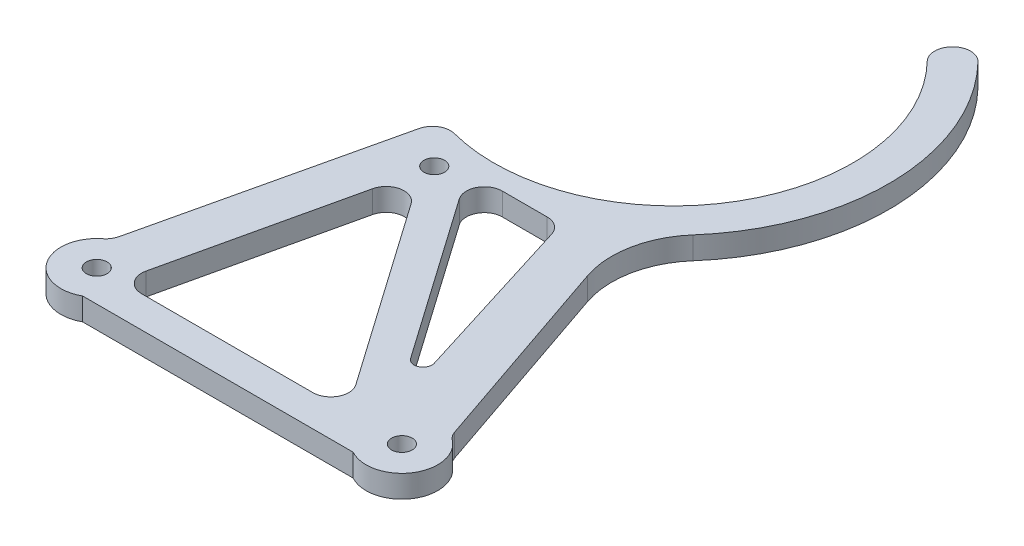
ISO-10303-21;
HEADER;
FILE_DESCRIPTION(('STEP AP214'),'2;1');
FILE_NAME('part.step','',(''),(''),'','','');
FILE_SCHEMA(('AUTOMOTIVE_DESIGN { 1 0 10303 214 1 1 1 1 }'));
ENDSEC;
DATA;
#1=APPLICATION_CONTEXT('core data for automotive mechanical design processes');
#2=APPLICATION_PROTOCOL_DEFINITION('international standard','automotive_design',2000,#1);
#3=PRODUCT_CONTEXT('',#1,'mechanical');
#4=PRODUCT('Part','Part','',(#3));
#5=PRODUCT_RELATED_PRODUCT_CATEGORY('part','',(#4));
#6=PRODUCT_DEFINITION_FORMATION('','',#4);
#7=PRODUCT_DEFINITION_CONTEXT('part definition',#1,'design');
#8=PRODUCT_DEFINITION('design','',#6,#7);
#9=PRODUCT_DEFINITION_SHAPE('','',#8);
#10=(LENGTH_UNIT() NAMED_UNIT(*) SI_UNIT(.MILLI.,.METRE.));
#11=(NAMED_UNIT(*) PLANE_ANGLE_UNIT() SI_UNIT($,.RADIAN.));
#12=(NAMED_UNIT(*) SI_UNIT($,.STERADIAN.) SOLID_ANGLE_UNIT());
#13=UNCERTAINTY_MEASURE_WITH_UNIT(LENGTH_MEASURE(1.E-05),#10,'distance_accuracy_value','');
#14=(GEOMETRIC_REPRESENTATION_CONTEXT(3) GLOBAL_UNCERTAINTY_ASSIGNED_CONTEXT((#13)) GLOBAL_UNIT_ASSIGNED_CONTEXT((#10,
#11,#12)) REPRESENTATION_CONTEXT('',''));
#15=CARTESIAN_POINT('',(0.,0.,0.));
#16=DIRECTION('',(0.,0.,1.));
#17=DIRECTION('',(1.,0.,0.));
#18=AXIS2_PLACEMENT_3D('',#15,#16,#17);
#19=CARTESIAN_POINT('',(0.,3.175,0.));
#20=DIRECTION('',(0.,1.,0.));
#21=DIRECTION('',(0.,0.,1.));
#22=AXIS2_PLACEMENT_3D('',#19,#20,#21);
#23=PLANE('',#22);
#24=CARTESIAN_POINT('',(11.43,3.175,-36.322));
#25=DIRECTION('',(0.,1.,0.));
#26=DIRECTION('',(0.,0.,1.));
#27=AXIS2_PLACEMENT_3D('',#24,#25,#26);
#28=CIRCLE('',#27,1.4605);
#29=CARTESIAN_POINT('',(11.43,3.175,-34.8615));
#30=VERTEX_POINT('',#29);
#31=EDGE_CURVE('E499',#30,#30,#28,.T.);
#32=ORIENTED_EDGE('',*,*,#31,.F.);
#33=EDGE_LOOP('',(#32));
#34=FACE_BOUND('',#33,.T.);
#35=CARTESIAN_POINT('',(15.2500981494995,3.175,-66.3346669360728));
#36=DIRECTION('',(0.,1.,0.));
#37=DIRECTION('',(0.,0.,1.));
#38=AXIS2_PLACEMENT_3D('',#35,#36,#37);
#39=CIRCLE('',#38,25.4);
#40=CARTESIAN_POINT('',(8.84643119143334,3.175,-41.7551419306914));
#41=VERTEX_POINT('',#40);
#42=CARTESIAN_POINT('',(33.4372190975799,3.175,-84.0656745673355));
#43=VERTEX_POINT('',#42);
#44=EDGE_CURVE('E387',#41,#43,#39,.T.);
#45=ORIENTED_EDGE('',*,*,#44,.F.);
#46=CARTESIAN_POINT('',(8.20606449562672,3.175,-39.2971894301532));
#47=DIRECTION('',(0.,1.,0.));
#48=DIRECTION('',(0.,0.,1.));
#49=AXIS2_PLACEMENT_3D('',#46,#47,#48);
#50=CIRCLE('',#49,2.54);
#51=CARTESIAN_POINT('',(5.73135353615715,3.175,-39.8693831622765));
#52=VERTEX_POINT('',#51);
#53=EDGE_CURVE('E347',#41,#52,#50,.T.);
#54=ORIENTED_EDGE('',*,*,#53,.T.);
#55=DIRECTION('',(0.225273122883191,0.,-0.974295653334477));
#56=VECTOR('',#55,1.);
#57=CARTESIAN_POINT('',(-3.31013792904624,3.175,-0.765358139388464));
#58=LINE('',#57,#56);
#59=CARTESIAN_POINT('',(-2.23421693067037,3.175,-5.41866581601019));
#60=VERTEX_POINT('',#59);
#61=EDGE_CURVE('E407',#60,#52,#58,.T.);
#62=ORIENTED_EDGE('',*,*,#61,.F.);
#63=CARTESIAN_POINT('',(-4.70892789013994,3.175,-5.99085954813349));
#64=DIRECTION('',(0.,1.,0.));
#65=DIRECTION('',(0.,0.,1.));
#66=AXIS2_PLACEMENT_3D('',#63,#64,#65);
#67=CIRCLE('',#66,2.54);
#68=CARTESIAN_POINT('',(-3.13928526009329,3.175,-3.99390636542233));
#69=VERTEX_POINT('',#68);
#70=EDGE_CURVE('E228',#60,#69,#67,.F.);
#71=ORIENTED_EDGE('',*,*,#70,.T.);
#72=CARTESIAN_POINT('',(0.,3.175,0.));
#73=DIRECTION('',(0.,1.,0.));
#74=DIRECTION('',(0.,0.,1.));
#75=AXIS2_PLACEMENT_3D('',#72,#73,#74);
#76=CIRCLE('',#75,5.08);
#77=CARTESIAN_POINT('',(2.45934442484171,3.175,4.445));
#78=VERTEX_POINT('',#77);
#79=EDGE_CURVE('E220',#69,#78,#76,.T.);
#80=ORIENTED_EDGE('',*,*,#79,.T.);
#81=DIRECTION('',(1.,0.,0.));
#82=VECTOR('',#81,1.);
#83=CARTESIAN_POINT('',(0.,3.175,4.445));
#84=LINE('',#83,#82);
#85=CARTESIAN_POINT('',(40.7206555751583,3.175,4.445));
#86=VERTEX_POINT('',#85);
#87=EDGE_CURVE('E225',#78,#86,#84,.T.);
#88=ORIENTED_EDGE('',*,*,#87,.T.);
#89=CARTESIAN_POINT('',(43.18,3.175,0.));
#90=DIRECTION('',(0.,1.,0.));
#91=DIRECTION('',(0.,0.,1.));
#92=AXIS2_PLACEMENT_3D('',#89,#90,#91);
#93=CIRCLE('',#92,5.08000000000001);
#94=CARTESIAN_POINT('',(46.2933663551576,3.175,-4.01414373666074));
#95=VERTEX_POINT('',#94);
#96=EDGE_CURVE('E241',#86,#95,#93,.T.);
#97=ORIENTED_EDGE('',*,*,#96,.T.);
#98=CARTESIAN_POINT('',(47.8500495327364,3.175,-6.02121560499111));
#99=DIRECTION('',(0.,1.,0.));
#100=DIRECTION('',(0.,0.,1.));
#101=AXIS2_PLACEMENT_3D('',#98,#99,#100);
#102=CIRCLE('',#101,2.54);
#103=CARTESIAN_POINT('',(45.4464675004593,3.175,-5.20000100811969));
#104=VERTEX_POINT('',#103);
#105=EDGE_CURVE('E361',#95,#104,#102,.F.);
#106=ORIENTED_EDGE('',*,*,#105,.T.);
#107=DIRECTION('',(-0.323312833413946,0.,-0.946292138691771));
#108=VECTOR('',#107,1.);
#109=CARTESIAN_POINT('',(42.2868262008053,3.175,-14.4478359652935));
#110=LINE('',#109,#108);
#111=CARTESIAN_POINT('',(35.6913169063117,3.175,-33.7519833761604));
#112=VERTEX_POINT('',#111);
#113=EDGE_CURVE('E396',#104,#112,#110,.T.);
#114=ORIENTED_EDGE('',*,*,#113,.T.);
#115=CARTESIAN_POINT('',(47.7092270676971,3.175,-37.8580563605175));
#116=DIRECTION('',(0.,1.,0.));
#117=DIRECTION('',(0.,0.,1.));
#118=AXIS2_PLACEMENT_3D('',#115,#116,#117);
#119=CIRCLE('',#118,12.7);
#120=CARTESIAN_POINT('',(38.1624244446978,3.175,-46.2335300592103));
#121=VERTEX_POINT('',#120);
#122=EDGE_CURVE('E320',#112,#121,#119,.F.);
#123=ORIENTED_EDGE('',*,*,#122,.T.);
#124=CARTESIAN_POINT('',(15.2500981494995,3.175,-66.3346669360728));
#125=DIRECTION('',(0.,1.,0.));
#126=DIRECTION('',(0.,0.,1.));
#127=AXIS2_PLACEMENT_3D('',#124,#125,#126);
#128=CIRCLE('',#127,30.48);
#129=CARTESIAN_POINT('',(37.074643287196,3.175,-87.611876093588));
#130=VERTEX_POINT('',#129);
#131=EDGE_CURVE('E384',#130,#121,#128,.F.);
#132=ORIENTED_EDGE('',*,*,#131,.F.);
#133=CARTESIAN_POINT('',(35.2559311923879,3.175,-85.8387753304617));
#134=DIRECTION('',(0.,1.,0.));
#135=DIRECTION('',(0.,0.,1.));
#136=AXIS2_PLACEMENT_3D('',#133,#134,#135);
#137=CIRCLE('',#136,2.54);
#138=CARTESIAN_POINT('',(33.3248350297801,3.175,-87.4887655155118));
#139=VERTEX_POINT('',#138);
#140=EDGE_CURVE('E345',#130,#139,#137,.T.);
#141=ORIENTED_EDGE('',*,*,#140,.T.);
#142=CARTESIAN_POINT('',(35.2559311923879,3.175,-85.8387753304617));
#143=DIRECTION('',(0.,1.,0.));
#144=DIRECTION('',(0.,0.,1.));
#145=AXIS2_PLACEMENT_3D('',#142,#143,#144);
#146=CIRCLE('',#145,2.54);
#147=EDGE_CURVE('E343',#139,#43,#146,.T.);
#148=ORIENTED_EDGE('',*,*,#147,.T.);
#149=EDGE_LOOP('',(#45,#54,#62,#71,#80,#88,#97,#106,#114,#123,#132,#141,#148));
#150=FACE_BOUND('',#149,.T.);
#151=CARTESIAN_POINT('',(0.,3.175,0.));
#152=DIRECTION('',(0.,1.,0.));
#153=DIRECTION('',(0.,0.,1.));
#154=AXIS2_PLACEMENT_3D('',#151,#152,#153);
#155=CIRCLE('',#154,1.4605);
#156=CARTESIAN_POINT('',(0.,3.175,1.4605));
#157=VERTEX_POINT('',#156);
#158=EDGE_CURVE('E232',#157,#157,#155,.T.);
#159=ORIENTED_EDGE('',*,*,#158,.F.);
#160=EDGE_LOOP('',(#159));
#161=FACE_BOUND('',#160,.T.);
#162=CARTESIAN_POINT('',(43.18,3.175,0.));
#163=DIRECTION('',(0.,1.,0.));
#164=DIRECTION('',(0.,0.,1.));
#165=AXIS2_PLACEMENT_3D('',#162,#163,#164);
#166=CIRCLE('',#165,1.46050000000001);
#167=CARTESIAN_POINT('',(43.18,3.175,1.46050000000001));
#168=VERTEX_POINT('',#167);
#169=EDGE_CURVE('E251',#168,#168,#166,.T.);
#170=ORIENTED_EDGE('',*,*,#169,.F.);
#171=EDGE_LOOP('',(#170));
#172=FACE_BOUND('',#171,.T.);
#173=DIRECTION('',(0.57357643635105,0.,0.819152044288989));
#174=VECTOR('',#173,1.);
#175=CARTESIAN_POINT('',(27.5646468935247,3.175,-19.3009735429351));
#176=LINE('',#175,#174);
#177=CARTESIAN_POINT('',(17.2000752672967,3.175,-34.1031158516683));
#178=VERTEX_POINT('',#177);
#179=CARTESIAN_POINT('',(33.3175160696928,3.175,-11.0850248959425));
#180=VERTEX_POINT('',#179);
#181=EDGE_CURVE('E385',#178,#180,#176,.T.);
#182=ORIENTED_EDGE('',*,*,#181,.F.);
#183=CARTESIAN_POINT('',(19.2807214597907,3.175,-35.56));
#184=DIRECTION('',(0.,1.,0.));
#185=DIRECTION('',(0.,0.,1.));
#186=AXIS2_PLACEMENT_3D('',#183,#184,#185);
#187=CIRCLE('',#186,2.54);
#188=CARTESIAN_POINT('',(19.2807214597907,3.175,-38.1));
#189=VERTEX_POINT('',#188);
#190=EDGE_CURVE('E294',#178,#189,#187,.F.);
#191=ORIENTED_EDGE('',*,*,#190,.T.);
#192=DIRECTION('',(1.,0.,0.));
#193=VECTOR('',#192,1.);
#194=CARTESIAN_POINT('',(0.,3.175,-38.1));
#195=LINE('',#194,#193);
#196=CARTESIAN_POINT('',(25.6264955663798,3.175,-38.1));
#197=VERTEX_POINT('',#196);
#198=EDGE_CURVE('E389',#189,#197,#195,.T.);
#199=ORIENTED_EDGE('',*,*,#198,.T.);
#200=CARTESIAN_POINT('',(25.6264955663798,3.175,-35.56));
#201=DIRECTION('',(0.,1.,0.));
#202=DIRECTION('',(0.,0.,1.));
#203=AXIS2_PLACEMENT_3D('',#200,#201,#202);
#204=CIRCLE('',#203,2.54);
#205=CARTESIAN_POINT('',(28.051446795848,3.175,-36.3157853760829));
#206=VERTEX_POINT('',#205);
#207=EDGE_CURVE('E302',#197,#206,#204,.F.);
#208=ORIENTED_EDGE('',*,*,#207,.T.);
#209=DIRECTION('',(0.29755329767044,0.,0.954705208452036));
#210=VECTOR('',#209,1.);
#211=CARTESIAN_POINT('',(35.8842603197392,3.175,-11.1840596427828));
#212=LINE('',#211,#210);
#213=CARTESIAN_POINT('',(35.5703147806739,3.175,-12.1913596581498));
#214=VERTEX_POINT('',#213);
#215=EDGE_CURVE('E377',#206,#214,#212,.T.);
#216=ORIENTED_EDGE('',*,*,#215,.T.);
#217=CARTESIAN_POINT('',(34.3578391659398,3.175,-11.8134669701083));
#218=DIRECTION('',(0.,1.,0.));
#219=DIRECTION('',(0.,0.,1.));
#220=AXIS2_PLACEMENT_3D('',#217,#218,#219);
#221=CIRCLE('',#220,1.27);
#222=EDGE_CURVE('E62',#214,#180,#221,.F.);
#223=ORIENTED_EDGE('',*,*,#222,.T.);
#224=EDGE_LOOP('',(#182,#191,#199,#208,#216,#223));
#225=FACE_BOUND('',#224,.T.);
#226=DIRECTION('',(-1.,0.,0.));
#227=VECTOR('',#226,1.);
#228=CARTESIAN_POINT('',(0.,3.175,0.));
#229=LINE('',#228,#227);
#230=CARTESIAN_POINT('',(30.5795400792316,3.175,0.));
#231=VERTEX_POINT('',#230);
#232=CARTESIAN_POINT('',(6.35750869969889,3.175,0.));
#233=VERTEX_POINT('',#232);
#234=EDGE_CURVE('E509',#231,#233,#229,.T.);
#235=ORIENTED_EDGE('',*,*,#234,.T.);
#236=CARTESIAN_POINT('',(6.35750869969889,3.175,-2.54));
#237=DIRECTION('',(0.,1.,0.));
#238=DIRECTION('',(0.,0.,1.));
#239=AXIS2_PLACEMENT_3D('',#236,#237,#238);
#240=CIRCLE('',#239,2.54);
#241=CARTESIAN_POINT('',(3.88075108191546,3.175,-3.10326876600051));
#242=VERTEX_POINT('',#241);
#243=EDGE_CURVE('E310',#233,#242,#240,.F.);
#244=ORIENTED_EDGE('',*,*,#243,.T.);
#245=DIRECTION('',(0.221759356693111,0.,-0.975101424324187));
#246=VECTOR('',#245,1.);
#247=CARTESIAN_POINT('',(3.01886235100801,3.175,0.686555220005522));
#248=LINE('',#247,#246);
#249=CARTESIAN_POINT('',(9.8191344603085,3.175,-29.2150242148023));
#250=VERTEX_POINT('',#249);
#251=EDGE_CURVE('E506',#242,#250,#248,.T.);
#252=ORIENTED_EDGE('',*,*,#251,.T.);
#253=CARTESIAN_POINT('',(12.2958920780919,3.175,-28.6517554488018));
#254=DIRECTION('',(0.,1.,0.));
#255=DIRECTION('',(0.,0.,1.));
#256=AXIS2_PLACEMENT_3D('',#253,#254,#255);
#257=CIRCLE('',#256,2.54);
#258=CARTESIAN_POINT('',(14.376538270586,3.175,-30.1086395971334));
#259=VERTEX_POINT('',#258);
#260=EDGE_CURVE('E298',#250,#259,#257,.F.);
#261=ORIENTED_EDGE('',*,*,#260,.T.);
#262=DIRECTION('',(0.57357643635105,0.,0.819152044288989));
#263=VECTOR('',#262,1.);
#264=CARTESIAN_POINT('',(23.7932352008737,3.175,-16.6602026460485));
#265=LINE('',#264,#263);
#266=CARTESIAN_POINT('',(32.6601862717256,3.175,-3.99688414833168));
#267=VERTEX_POINT('',#266);
#268=EDGE_CURVE('E369',#259,#267,#265,.T.);
#269=ORIENTED_EDGE('',*,*,#268,.T.);
#270=CARTESIAN_POINT('',(30.5795400792316,3.175,-2.54000000000001));
#271=DIRECTION('',(0.,1.,0.));
#272=DIRECTION('',(0.,0.,1.));
#273=AXIS2_PLACEMENT_3D('',#270,#271,#272);
#274=CIRCLE('',#273,2.54);
#275=EDGE_CURVE('E306',#267,#231,#274,.F.);
#276=ORIENTED_EDGE('',*,*,#275,.T.);
#277=EDGE_LOOP('',(#235,#244,#252,#261,#269,#276));
#278=FACE_BOUND('',#277,.T.);
#279=ADVANCED_FACE('F53',(#34,#150,#161,#172,#225,#278),#23,.T.);
#280=CARTESIAN_POINT('',(0.,0.,0.));
#281=DIRECTION('',(0.,1.,0.));
#282=DIRECTION('',(0.,0.,1.));
#283=AXIS2_PLACEMENT_3D('',#280,#281,#282);
#284=PLANE('',#283);
#285=CARTESIAN_POINT('',(11.43,0.,-36.322));
#286=DIRECTION('',(0.,1.,0.));
#287=DIRECTION('',(0.,0.,1.));
#288=AXIS2_PLACEMENT_3D('',#285,#286,#287);
#289=CIRCLE('',#288,1.4605);
#290=CARTESIAN_POINT('',(11.43,0.,-34.8615));
#291=VERTEX_POINT('',#290);
#292=EDGE_CURVE('E57',#291,#291,#289,.T.);
#293=ORIENTED_EDGE('',*,*,#292,.T.);
#294=EDGE_LOOP('',(#293));
#295=FACE_BOUND('',#294,.T.);
#296=DIRECTION('',(1.,0.,0.));
#297=VECTOR('',#296,1.);
#298=CARTESIAN_POINT('',(0.,0.,-38.1));
#299=LINE('',#298,#297);
#300=CARTESIAN_POINT('',(19.2807214597907,0.,-38.1));
#301=VERTEX_POINT('',#300);
#302=CARTESIAN_POINT('',(25.6264955663798,0.,-38.1));
#303=VERTEX_POINT('',#302);
#304=EDGE_CURVE('E257',#301,#303,#299,.T.);
#305=ORIENTED_EDGE('',*,*,#304,.F.);
#306=CARTESIAN_POINT('',(19.2807214597907,0.,-35.56));
#307=DIRECTION('',(0.,1.,0.));
#308=DIRECTION('',(0.,0.,1.));
#309=AXIS2_PLACEMENT_3D('',#306,#307,#308);
#310=CIRCLE('',#309,2.54);
#311=CARTESIAN_POINT('',(17.2000752672967,0.,-34.1031158516683));
#312=VERTEX_POINT('',#311);
#313=EDGE_CURVE('E296',#301,#312,#310,.T.);
#314=ORIENTED_EDGE('',*,*,#313,.T.);
#315=DIRECTION('',(0.57357643635105,0.,0.819152044288989));
#316=VECTOR('',#315,1.);
#317=CARTESIAN_POINT('',(27.5646468935247,0.,-19.3009735429351));
#318=LINE('',#317,#316);
#319=CARTESIAN_POINT('',(33.3175160696928,0.,-11.0850248959425));
#320=VERTEX_POINT('',#319);
#321=EDGE_CURVE('E247',#312,#320,#318,.T.);
#322=ORIENTED_EDGE('',*,*,#321,.T.);
#323=CARTESIAN_POINT('',(34.3578391659398,0.,-11.8134669701083));
#324=DIRECTION('',(0.,1.,0.));
#325=DIRECTION('',(0.,0.,1.));
#326=AXIS2_PLACEMENT_3D('',#323,#324,#325);
#327=CIRCLE('',#326,1.27);
#328=CARTESIAN_POINT('',(35.5703147806739,0.,-12.1913596581498));
#329=VERTEX_POINT('',#328);
#330=EDGE_CURVE('E12',#320,#329,#327,.T.);
#331=ORIENTED_EDGE('',*,*,#330,.T.);
#332=DIRECTION('',(0.29755329767044,0.,0.954705208452036));
#333=VECTOR('',#332,1.);
#334=CARTESIAN_POINT('',(35.8842603197392,0.,-11.1840596427828));
#335=LINE('',#334,#333);
#336=CARTESIAN_POINT('',(28.051446795848,0.,-36.3157853760829));
#337=VERTEX_POINT('',#336);
#338=EDGE_CURVE('E249',#337,#329,#335,.T.);
#339=ORIENTED_EDGE('',*,*,#338,.F.);
#340=CARTESIAN_POINT('',(25.6264955663798,0.,-35.56));
#341=DIRECTION('',(0.,1.,0.));
#342=DIRECTION('',(0.,0.,1.));
#343=AXIS2_PLACEMENT_3D('',#340,#341,#342);
#344=CIRCLE('',#343,2.54);
#345=EDGE_CURVE('E304',#337,#303,#344,.T.);
#346=ORIENTED_EDGE('',*,*,#345,.T.);
#347=EDGE_LOOP('',(#305,#314,#322,#331,#339,#346));
#348=FACE_BOUND('',#347,.T.);
#349=DIRECTION('',(0.225273122883191,0.,-0.974295653334477));
#350=VECTOR('',#349,1.);
#351=CARTESIAN_POINT('',(-3.31013792904624,0.,-0.765358139388464));
#352=LINE('',#351,#350);
#353=CARTESIAN_POINT('',(-2.23421693067037,0.,-5.41866581601019));
#354=VERTEX_POINT('',#353);
#355=CARTESIAN_POINT('',(5.73135353615715,0.,-39.8693831622765));
#356=VERTEX_POINT('',#355);
#357=EDGE_CURVE('E399',#354,#356,#352,.T.);
#358=ORIENTED_EDGE('',*,*,#357,.T.);
#359=CARTESIAN_POINT('',(8.20606449562672,0.,-39.2971894301532));
#360=DIRECTION('',(0.,1.,0.));
#361=DIRECTION('',(0.,0.,1.));
#362=AXIS2_PLACEMENT_3D('',#359,#360,#361);
#363=CIRCLE('',#362,2.54);
#364=CARTESIAN_POINT('',(8.84643119143334,0.,-41.7551419306914));
#365=VERTEX_POINT('',#364);
#366=EDGE_CURVE('E353',#356,#365,#363,.F.);
#367=ORIENTED_EDGE('',*,*,#366,.T.);
#368=CARTESIAN_POINT('',(15.2500981494995,0.,-66.3346669360728));
#369=DIRECTION('',(0.,1.,0.));
#370=DIRECTION('',(0.,0.,1.));
#371=AXIS2_PLACEMENT_3D('',#368,#369,#370);
#372=CIRCLE('',#371,25.4);
#373=CARTESIAN_POINT('',(33.4372190975799,0.,-84.0656745673355));
#374=VERTEX_POINT('',#373);
#375=EDGE_CURVE('E395',#365,#374,#372,.T.);
#376=ORIENTED_EDGE('',*,*,#375,.T.);
#377=CARTESIAN_POINT('',(35.2559311923879,0.,-85.8387753304617));
#378=DIRECTION('',(0.,1.,0.));
#379=DIRECTION('',(0.,0.,1.));
#380=AXIS2_PLACEMENT_3D('',#377,#378,#379);
#381=CIRCLE('',#380,2.54);
#382=CARTESIAN_POINT('',(33.3248350297801,0.,-87.4887655155118));
#383=VERTEX_POINT('',#382);
#384=EDGE_CURVE('E349',#374,#383,#381,.F.);
#385=ORIENTED_EDGE('',*,*,#384,.T.);
#386=CARTESIAN_POINT('',(35.2559311923879,0.,-85.8387753304617));
#387=DIRECTION('',(0.,1.,0.));
#388=DIRECTION('',(0.,0.,1.));
#389=AXIS2_PLACEMENT_3D('',#386,#387,#388);
#390=CIRCLE('',#389,2.54);
#391=CARTESIAN_POINT('',(37.074643287196,0.,-87.611876093588));
#392=VERTEX_POINT('',#391);
#393=EDGE_CURVE('E351',#383,#392,#390,.F.);
#394=ORIENTED_EDGE('',*,*,#393,.T.);
#395=CARTESIAN_POINT('',(15.2500981494995,0.,-66.3346669360728));
#396=DIRECTION('',(0.,1.,0.));
#397=DIRECTION('',(0.,0.,1.));
#398=AXIS2_PLACEMENT_3D('',#395,#396,#397);
#399=CIRCLE('',#398,30.48);
#400=CARTESIAN_POINT('',(38.1624244446978,0.,-46.2335300592103));
#401=VERTEX_POINT('',#400);
#402=EDGE_CURVE('E393',#392,#401,#399,.F.);
#403=ORIENTED_EDGE('',*,*,#402,.T.);
#404=CARTESIAN_POINT('',(47.7092270676971,0.,-37.8580563605175));
#405=DIRECTION('',(0.,1.,0.));
#406=DIRECTION('',(0.,0.,1.));
#407=AXIS2_PLACEMENT_3D('',#404,#405,#406);
#408=CIRCLE('',#407,12.7);
#409=CARTESIAN_POINT('',(35.6913169063117,0.,-33.7519833761604));
#410=VERTEX_POINT('',#409);
#411=EDGE_CURVE('E323',#401,#410,#408,.T.);
#412=ORIENTED_EDGE('',*,*,#411,.T.);
#413=DIRECTION('',(-0.323312833413946,0.,-0.946292138691771));
#414=VECTOR('',#413,1.);
#415=CARTESIAN_POINT('',(42.2868262008053,0.,-14.4478359652935));
#416=LINE('',#415,#414);
#417=CARTESIAN_POINT('',(45.4464675004593,0.,-5.20000100811969));
#418=VERTEX_POINT('',#417);
#419=EDGE_CURVE('E402',#418,#410,#416,.T.);
#420=ORIENTED_EDGE('',*,*,#419,.F.);
#421=CARTESIAN_POINT('',(47.8500495327364,0.,-6.02121560499111));
#422=DIRECTION('',(0.,1.,0.));
#423=DIRECTION('',(0.,0.,1.));
#424=AXIS2_PLACEMENT_3D('',#421,#422,#423);
#425=CIRCLE('',#424,2.54);
#426=CARTESIAN_POINT('',(46.2933663551576,0.,-4.01414373666074));
#427=VERTEX_POINT('',#426);
#428=EDGE_CURVE('E363',#418,#427,#425,.T.);
#429=ORIENTED_EDGE('',*,*,#428,.T.);
#430=CARTESIAN_POINT('',(43.18,0.,0.));
#431=DIRECTION('',(0.,1.,0.));
#432=DIRECTION('',(0.,0.,1.));
#433=AXIS2_PLACEMENT_3D('',#430,#431,#432);
#434=CIRCLE('',#433,5.08000000000001);
#435=CARTESIAN_POINT('',(40.7206555751583,0.,4.445));
#436=VERTEX_POINT('',#435);
#437=EDGE_CURVE('E422',#436,#427,#434,.T.);
#438=ORIENTED_EDGE('',*,*,#437,.F.);
#439=DIRECTION('',(1.,0.,0.));
#440=VECTOR('',#439,1.);
#441=CARTESIAN_POINT('',(0.,0.,4.445));
#442=LINE('',#441,#440);
#443=CARTESIAN_POINT('',(2.45934442484171,0.,4.445));
#444=VERTEX_POINT('',#443);
#445=EDGE_CURVE('E420',#444,#436,#442,.T.);
#446=ORIENTED_EDGE('',*,*,#445,.F.);
#447=CARTESIAN_POINT('',(0.,0.,0.));
#448=DIRECTION('',(0.,1.,0.));
#449=DIRECTION('',(0.,0.,1.));
#450=AXIS2_PLACEMENT_3D('',#447,#448,#449);
#451=CIRCLE('',#450,5.08);
#452=CARTESIAN_POINT('',(-3.13928526009329,0.,-3.99390636542233));
#453=VERTEX_POINT('',#452);
#454=EDGE_CURVE('E245',#453,#444,#451,.T.);
#455=ORIENTED_EDGE('',*,*,#454,.F.);
#456=CARTESIAN_POINT('',(-4.70892789013994,0.,-5.99085954813349));
#457=DIRECTION('',(0.,1.,0.));
#458=DIRECTION('',(0.,0.,1.));
#459=AXIS2_PLACEMENT_3D('',#456,#457,#458);
#460=CIRCLE('',#459,2.54);
#461=EDGE_CURVE('E359',#453,#354,#460,.T.);
#462=ORIENTED_EDGE('',*,*,#461,.T.);
#463=EDGE_LOOP('',(#358,#367,#376,#385,#394,#403,#412,#420,#429,#438,#446,#455,#462));
#464=FACE_BOUND('',#463,.T.);
#465=CARTESIAN_POINT('',(0.,0.,0.));
#466=DIRECTION('',(0.,1.,0.));
#467=DIRECTION('',(0.,0.,1.));
#468=AXIS2_PLACEMENT_3D('',#465,#466,#467);
#469=CIRCLE('',#468,1.4605);
#470=CARTESIAN_POINT('',(0.,0.,1.4605));
#471=VERTEX_POINT('',#470);
#472=EDGE_CURVE('E403',#471,#471,#469,.T.);
#473=ORIENTED_EDGE('',*,*,#472,.T.);
#474=EDGE_LOOP('',(#473));
#475=FACE_BOUND('',#474,.T.);
#476=CARTESIAN_POINT('',(43.18,0.,0.));
#477=DIRECTION('',(0.,1.,0.));
#478=DIRECTION('',(0.,0.,1.));
#479=AXIS2_PLACEMENT_3D('',#476,#477,#478);
#480=CIRCLE('',#479,1.46050000000001);
#481=CARTESIAN_POINT('',(43.18,0.,1.46050000000001));
#482=VERTEX_POINT('',#481);
#483=EDGE_CURVE('E412',#482,#482,#480,.T.);
#484=ORIENTED_EDGE('',*,*,#483,.T.);
#485=EDGE_LOOP('',(#484));
#486=FACE_BOUND('',#485,.T.);
#487=DIRECTION('',(0.57357643635105,0.,0.819152044288989));
#488=VECTOR('',#487,1.);
#489=CARTESIAN_POINT('',(23.7932352008737,0.,-16.6602026460485));
#490=LINE('',#489,#488);
#491=CARTESIAN_POINT('',(14.376538270586,0.,-30.1086395971334));
#492=VERTEX_POINT('',#491);
#493=CARTESIAN_POINT('',(32.6601862717256,0.,-3.99688414833168));
#494=VERTEX_POINT('',#493);
#495=EDGE_CURVE('E266',#492,#494,#490,.T.);
#496=ORIENTED_EDGE('',*,*,#495,.F.);
#497=CARTESIAN_POINT('',(12.2958920780919,0.,-28.6517554488018));
#498=DIRECTION('',(0.,1.,0.));
#499=DIRECTION('',(0.,0.,1.));
#500=AXIS2_PLACEMENT_3D('',#497,#498,#499);
#501=CIRCLE('',#500,2.54);
#502=CARTESIAN_POINT('',(9.8191344603085,0.,-29.2150242148023));
#503=VERTEX_POINT('',#502);
#504=EDGE_CURVE('E300',#492,#503,#501,.T.);
#505=ORIENTED_EDGE('',*,*,#504,.T.);
#506=DIRECTION('',(0.221759356693111,0.,-0.975101424324187));
#507=VECTOR('',#506,1.);
#508=CARTESIAN_POINT('',(3.01886235100801,0.,0.686555220005522));
#509=LINE('',#508,#507);
#510=CARTESIAN_POINT('',(3.88075108191546,0.,-3.10326876600051));
#511=VERTEX_POINT('',#510);
#512=EDGE_CURVE('E260',#511,#503,#509,.T.);
#513=ORIENTED_EDGE('',*,*,#512,.F.);
#514=CARTESIAN_POINT('',(6.35750869969889,0.,-2.54));
#515=DIRECTION('',(0.,1.,0.));
#516=DIRECTION('',(0.,0.,1.));
#517=AXIS2_PLACEMENT_3D('',#514,#515,#516);
#518=CIRCLE('',#517,2.54);
#519=CARTESIAN_POINT('',(6.35750869969889,0.,0.));
#520=VERTEX_POINT('',#519);
#521=EDGE_CURVE('E312',#511,#520,#518,.T.);
#522=ORIENTED_EDGE('',*,*,#521,.T.);
#523=DIRECTION('',(-1.,0.,0.));
#524=VECTOR('',#523,1.);
#525=CARTESIAN_POINT('',(0.,0.,0.));
#526=LINE('',#525,#524);
#527=CARTESIAN_POINT('',(30.5795400792316,0.,0.));
#528=VERTEX_POINT('',#527);
#529=EDGE_CURVE('E263',#528,#520,#526,.T.);
#530=ORIENTED_EDGE('',*,*,#529,.F.);
#531=CARTESIAN_POINT('',(30.5795400792316,0.,-2.54000000000001));
#532=DIRECTION('',(0.,1.,0.));
#533=DIRECTION('',(0.,0.,1.));
#534=AXIS2_PLACEMENT_3D('',#531,#532,#533);
#535=CIRCLE('',#534,2.54);
#536=EDGE_CURVE('E308',#528,#494,#535,.T.);
#537=ORIENTED_EDGE('',*,*,#536,.T.);
#538=EDGE_LOOP('',(#496,#505,#513,#522,#530,#537));
#539=FACE_BOUND('',#538,.T.);
#540=ADVANCED_FACE('F427',(#295,#348,#464,#475,#486,#539),#284,.F.);
#541=CARTESIAN_POINT('',(0.,3.175,0.));
#542=DIRECTION('',(0.,-1.,0.));
#543=DIRECTION('',(0.,0.,-1.));
#544=AXIS2_PLACEMENT_3D('',#541,#542,#543);
#545=CYLINDRICAL_SURFACE('',#544,5.08);
#546=ORIENTED_EDGE('',*,*,#79,.F.);
#547=DIRECTION('',(0.,-1.,0.));
#548=VECTOR('',#547,1.);
#549=CARTESIAN_POINT('',(-3.13928526009329,3.175,-3.99390636542233));
#550=LINE('',#549,#548);
#551=EDGE_CURVE('E331',#69,#453,#550,.T.);
#552=ORIENTED_EDGE('',*,*,#551,.T.);
#553=ORIENTED_EDGE('',*,*,#454,.T.);
#554=DIRECTION('',(0.,-1.,0.));
#555=VECTOR('',#554,1.);
#556=CARTESIAN_POINT('',(2.45934442484171,3.175,4.445));
#557=LINE('',#556,#555);
#558=EDGE_CURVE('E237',#78,#444,#557,.T.);
#559=ORIENTED_EDGE('',*,*,#558,.F.);
#560=EDGE_LOOP('',(#546,#552,#553,#559));
#561=FACE_BOUND('',#560,.T.);
#562=ADVANCED_FACE('F243',(#561),#545,.T.);
#563=CARTESIAN_POINT('',(0.,3.175,4.445));
#564=DIRECTION('',(0.,0.,-1.));
#565=DIRECTION('',(-1.,0.,0.));
#566=AXIS2_PLACEMENT_3D('',#563,#564,#565);
#567=PLANE('',#566);
#568=ORIENTED_EDGE('',*,*,#445,.T.);
#569=DIRECTION('',(0.,-1.,0.));
#570=VECTOR('',#569,1.);
#571=CARTESIAN_POINT('',(40.7206555751583,3.175,4.445));
#572=LINE('',#571,#570);
#573=EDGE_CURVE('E239',#86,#436,#572,.T.);
#574=ORIENTED_EDGE('',*,*,#573,.F.);
#575=ORIENTED_EDGE('',*,*,#87,.F.);
#576=ORIENTED_EDGE('',*,*,#558,.T.);
#577=EDGE_LOOP('',(#568,#574,#575,#576));
#578=FACE_BOUND('',#577,.T.);
#579=ADVANCED_FACE('F236',(#578),#567,.F.);
#580=CARTESIAN_POINT('',(43.18,3.175,0.));
#581=DIRECTION('',(0.,-1.,0.));
#582=DIRECTION('',(0.,0.,-1.));
#583=AXIS2_PLACEMENT_3D('',#580,#581,#582);
#584=CYLINDRICAL_SURFACE('',#583,5.08000000000001);
#585=ORIENTED_EDGE('',*,*,#437,.T.);
#586=DIRECTION('',(0.,-1.,0.));
#587=VECTOR('',#586,1.);
#588=CARTESIAN_POINT('',(46.2933663551576,3.175,-4.01414373666074));
#589=LINE('',#588,#587);
#590=EDGE_CURVE('E333',#427,#95,#589,.F.);
#591=ORIENTED_EDGE('',*,*,#590,.T.);
#592=ORIENTED_EDGE('',*,*,#96,.F.);
#593=ORIENTED_EDGE('',*,*,#573,.T.);
#594=EDGE_LOOP('',(#585,#591,#592,#593));
#595=FACE_BOUND('',#594,.T.);
#596=ADVANCED_FACE('F443',(#595),#584,.T.);
#597=CARTESIAN_POINT('',(0.,3.175,0.));
#598=DIRECTION('',(0.,-1.,0.));
#599=DIRECTION('',(0.,0.,-1.));
#600=AXIS2_PLACEMENT_3D('',#597,#598,#599);
#601=CYLINDRICAL_SURFACE('',#600,1.4605);
#602=ORIENTED_EDGE('',*,*,#158,.T.);
#603=EDGE_LOOP('',(#602));
#604=FACE_BOUND('',#603,.T.);
#605=ORIENTED_EDGE('',*,*,#472,.F.);
#606=EDGE_LOOP('',(#605));
#607=FACE_BOUND('',#606,.T.);
#608=ADVANCED_FACE('F433',(#604,#607),#601,.F.);
#609=CARTESIAN_POINT('',(43.18,3.175,0.));
#610=DIRECTION('',(0.,-1.,0.));
#611=DIRECTION('',(0.,0.,-1.));
#612=AXIS2_PLACEMENT_3D('',#609,#610,#611);
#613=CYLINDRICAL_SURFACE('',#612,1.46050000000001);
#614=ORIENTED_EDGE('',*,*,#169,.T.);
#615=EDGE_LOOP('',(#614));
#616=FACE_BOUND('',#615,.T.);
#617=ORIENTED_EDGE('',*,*,#483,.F.);
#618=EDGE_LOOP('',(#617));
#619=FACE_BOUND('',#618,.T.);
#620=ADVANCED_FACE('F430',(#616,#619),#613,.F.);
#621=CARTESIAN_POINT('',(15.2500981494995,0.,-66.3346669360728));
#622=DIRECTION('',(0.,1.,0.));
#623=DIRECTION('',(0.,0.,1.));
#624=AXIS2_PLACEMENT_3D('',#621,#622,#623);
#625=CYLINDRICAL_SURFACE('',#624,30.48);
#626=ORIENTED_EDGE('',*,*,#402,.F.);
#627=DIRECTION('',(0.,1.,0.));
#628=VECTOR('',#627,1.);
#629=CARTESIAN_POINT('',(37.074643287196,0.,-87.611876093588));
#630=LINE('',#629,#628);
#631=EDGE_CURVE('E355',#392,#130,#630,.T.);
#632=ORIENTED_EDGE('',*,*,#631,.T.);
#633=ORIENTED_EDGE('',*,*,#131,.T.);
#634=DIRECTION('',(0.,1.,0.));
#635=VECTOR('',#634,1.);
#636=CARTESIAN_POINT('',(38.1624244446978,0.,-46.2335300592103));
#637=LINE('',#636,#635);
#638=EDGE_CURVE('E317',#121,#401,#637,.F.);
#639=ORIENTED_EDGE('',*,*,#638,.T.);
#640=EDGE_LOOP('',(#626,#632,#633,#639));
#641=FACE_BOUND('',#640,.T.);
#642=ADVANCED_FACE('F432',(#641),#625,.T.);
#643=CARTESIAN_POINT('',(42.2868262008053,0.,-14.4478359652935));
#644=DIRECTION('',(0.946292138691771,0.,-0.323312833413946));
#645=DIRECTION('',(-0.323312833413946,0.,-0.946292138691771));
#646=AXIS2_PLACEMENT_3D('',#643,#644,#645);
#647=PLANE('',#646);
#648=ORIENTED_EDGE('',*,*,#113,.F.);
#649=DIRECTION('',(0.,-1.,0.));
#650=VECTOR('',#649,1.);
#651=CARTESIAN_POINT('',(45.4464675004593,0.,-5.20000100811969));
#652=LINE('',#651,#650);
#653=EDGE_CURVE('E336',#104,#418,#652,.T.);
#654=ORIENTED_EDGE('',*,*,#653,.T.);
#655=ORIENTED_EDGE('',*,*,#419,.T.);
#656=DIRECTION('',(0.,1.,0.));
#657=VECTOR('',#656,1.);
#658=CARTESIAN_POINT('',(35.6913169063117,0.,-33.7519833761604));
#659=LINE('',#658,#657);
#660=EDGE_CURVE('E314',#410,#112,#659,.T.);
#661=ORIENTED_EDGE('',*,*,#660,.T.);
#662=EDGE_LOOP('',(#648,#654,#655,#661));
#663=FACE_BOUND('',#662,.T.);
#664=ADVANCED_FACE('F440',(#663),#647,.T.);
#665=CARTESIAN_POINT('',(-3.31013792904624,0.,-0.765358139388464));
#666=DIRECTION('',(0.974295653334477,0.,0.225273122883191));
#667=DIRECTION('',(0.225273122883191,0.,-0.974295653334477));
#668=AXIS2_PLACEMENT_3D('',#665,#666,#667);
#669=PLANE('',#668);
#670=ORIENTED_EDGE('',*,*,#357,.F.);
#671=DIRECTION('',(0.,1.,0.));
#672=VECTOR('',#671,1.);
#673=CARTESIAN_POINT('',(-2.23421693067036,3.175,-5.41866581601019));
#674=LINE('',#673,#672);
#675=EDGE_CURVE('E328',#354,#60,#674,.T.);
#676=ORIENTED_EDGE('',*,*,#675,.T.);
#677=ORIENTED_EDGE('',*,*,#61,.T.);
#678=DIRECTION('',(0.,1.,0.));
#679=VECTOR('',#678,1.);
#680=CARTESIAN_POINT('',(5.73135353615715,0.,-39.8693831622765));
#681=LINE('',#680,#679);
#682=EDGE_CURVE('E326',#52,#356,#681,.F.);
#683=ORIENTED_EDGE('',*,*,#682,.T.);
#684=EDGE_LOOP('',(#670,#676,#677,#683));
#685=FACE_BOUND('',#684,.T.);
#686=ADVANCED_FACE('F461',(#685),#669,.F.);
#687=CARTESIAN_POINT('',(15.2500981494995,0.,-66.3346669360728));
#688=DIRECTION('',(0.,1.,0.));
#689=DIRECTION('',(0.,0.,1.));
#690=AXIS2_PLACEMENT_3D('',#687,#688,#689);
#691=CYLINDRICAL_SURFACE('',#690,25.4);
#692=ORIENTED_EDGE('',*,*,#375,.F.);
#693=DIRECTION('',(0.,1.,0.));
#694=VECTOR('',#693,1.);
#695=CARTESIAN_POINT('',(8.84643119143334,0.,-41.7551419306914));
#696=LINE('',#695,#694);
#697=EDGE_CURVE('E340',#365,#41,#696,.T.);
#698=ORIENTED_EDGE('',*,*,#697,.T.);
#699=ORIENTED_EDGE('',*,*,#44,.T.);
#700=DIRECTION('',(0.,1.,0.));
#701=VECTOR('',#700,1.);
#702=CARTESIAN_POINT('',(33.4372190975799,0.,-84.0656745673355));
#703=LINE('',#702,#701);
#704=EDGE_CURVE('E338',#43,#374,#703,.F.);
#705=ORIENTED_EDGE('',*,*,#704,.T.);
#706=EDGE_LOOP('',(#692,#698,#699,#705));
#707=FACE_BOUND('',#706,.T.);
#708=ADVANCED_FACE('F457',(#707),#691,.F.);
#709=CARTESIAN_POINT('',(0.,-22.225,-38.1));
#710=DIRECTION('',(0.,0.,1.));
#711=DIRECTION('',(1.,0.,0.));
#712=AXIS2_PLACEMENT_3D('',#709,#710,#711);
#713=PLANE('',#712);
#714=ORIENTED_EDGE('',*,*,#198,.F.);
#715=DIRECTION('',(0.,1.,0.));
#716=VECTOR('',#715,1.);
#717=CARTESIAN_POINT('',(19.2807214597907,-22.225,-38.1));
#718=LINE('',#717,#716);
#719=EDGE_CURVE('E275',#189,#301,#718,.F.);
#720=ORIENTED_EDGE('',*,*,#719,.T.);
#721=ORIENTED_EDGE('',*,*,#304,.T.);
#722=DIRECTION('',(0.,1.,0.));
#723=VECTOR('',#722,1.);
#724=CARTESIAN_POINT('',(25.6264955663798,3.175,-38.1));
#725=LINE('',#724,#723);
#726=EDGE_CURVE('E272',#303,#197,#725,.T.);
#727=ORIENTED_EDGE('',*,*,#726,.T.);
#728=EDGE_LOOP('',(#714,#720,#721,#727));
#729=FACE_BOUND('',#728,.T.);
#730=ADVANCED_FACE('F460',(#729),#713,.T.);
#731=CARTESIAN_POINT('',(35.8842603197392,-22.225,-11.1840596427828));
#732=DIRECTION('',(-0.954705208452036,0.,0.29755329767044));
#733=DIRECTION('',(0.29755329767044,0.,0.954705208452036));
#734=AXIS2_PLACEMENT_3D('',#731,#732,#733);
#735=PLANE('',#734);
#736=ORIENTED_EDGE('',*,*,#338,.T.);
#737=DIRECTION('',(0.,1.,0.));
#738=VECTOR('',#737,1.);
#739=CARTESIAN_POINT('',(35.5703147806739,-22.225,-12.1913596581498));
#740=LINE('',#739,#738);
#741=EDGE_CURVE('E365',#329,#214,#740,.T.);
#742=ORIENTED_EDGE('',*,*,#741,.T.);
#743=ORIENTED_EDGE('',*,*,#215,.F.);
#744=DIRECTION('',(0.,1.,0.));
#745=VECTOR('',#744,1.);
#746=CARTESIAN_POINT('',(28.051446795848,0.,-36.3157853760829));
#747=LINE('',#746,#745);
#748=EDGE_CURVE('E287',#206,#337,#747,.F.);
#749=ORIENTED_EDGE('',*,*,#748,.T.);
#750=EDGE_LOOP('',(#736,#742,#743,#749));
#751=FACE_BOUND('',#750,.T.);
#752=ADVANCED_FACE('F376',(#751),#735,.T.);
#753=CARTESIAN_POINT('',(27.5646468935247,-22.225,-19.3009735429351));
#754=DIRECTION('',(-0.819152044288989,0.,0.57357643635105));
#755=DIRECTION('',(0.57357643635105,0.,0.819152044288989));
#756=AXIS2_PLACEMENT_3D('',#753,#754,#755);
#757=PLANE('',#756);
#758=ORIENTED_EDGE('',*,*,#181,.T.);
#759=DIRECTION('',(0.,1.,0.));
#760=VECTOR('',#759,1.);
#761=CARTESIAN_POINT('',(33.3175160696928,-22.225,-11.0850248959425));
#762=LINE('',#761,#760);
#763=EDGE_CURVE('E75',#180,#320,#762,.F.);
#764=ORIENTED_EDGE('',*,*,#763,.T.);
#765=ORIENTED_EDGE('',*,*,#321,.F.);
#766=DIRECTION('',(0.,1.,0.));
#767=VECTOR('',#766,1.);
#768=CARTESIAN_POINT('',(17.2000752672967,-22.225,-34.1031158516683));
#769=LINE('',#768,#767);
#770=EDGE_CURVE('E269',#312,#178,#769,.T.);
#771=ORIENTED_EDGE('',*,*,#770,.T.);
#772=EDGE_LOOP('',(#758,#764,#765,#771));
#773=FACE_BOUND('',#772,.T.);
#774=ADVANCED_FACE('F472',(#773),#757,.F.);
#775=CARTESIAN_POINT('',(23.7932352008737,-22.225,-16.6602026460485));
#776=DIRECTION('',(-0.819152044288989,0.,0.57357643635105));
#777=DIRECTION('',(0.57357643635105,0.,0.819152044288989));
#778=AXIS2_PLACEMENT_3D('',#775,#776,#777);
#779=PLANE('',#778);
#780=ORIENTED_EDGE('',*,*,#268,.F.);
#781=DIRECTION('',(0.,1.,0.));
#782=VECTOR('',#781,1.);
#783=CARTESIAN_POINT('',(14.376538270586,0.,-30.1086395971334));
#784=LINE('',#783,#782);
#785=EDGE_CURVE('E285',#259,#492,#784,.F.);
#786=ORIENTED_EDGE('',*,*,#785,.T.);
#787=ORIENTED_EDGE('',*,*,#495,.T.);
#788=DIRECTION('',(0.,1.,0.));
#789=VECTOR('',#788,1.);
#790=CARTESIAN_POINT('',(32.6601862717256,3.175,-3.99688414833167));
#791=LINE('',#790,#789);
#792=EDGE_CURVE('E282',#494,#267,#791,.T.);
#793=ORIENTED_EDGE('',*,*,#792,.T.);
#794=EDGE_LOOP('',(#780,#786,#787,#793));
#795=FACE_BOUND('',#794,.T.);
#796=ADVANCED_FACE('F475',(#795),#779,.T.);
#797=CARTESIAN_POINT('',(0.,-22.225,0.));
#798=DIRECTION('',(0.,0.,-1.));
#799=DIRECTION('',(-1.,0.,0.));
#800=AXIS2_PLACEMENT_3D('',#797,#798,#799);
#801=PLANE('',#800);
#802=ORIENTED_EDGE('',*,*,#234,.F.);
#803=DIRECTION('',(0.,1.,0.));
#804=VECTOR('',#803,1.);
#805=CARTESIAN_POINT('',(30.5795400792316,0.,0.));
#806=LINE('',#805,#804);
#807=EDGE_CURVE('E292',#231,#528,#806,.F.);
#808=ORIENTED_EDGE('',*,*,#807,.T.);
#809=ORIENTED_EDGE('',*,*,#529,.T.);
#810=DIRECTION('',(0.,1.,0.));
#811=VECTOR('',#810,1.);
#812=CARTESIAN_POINT('',(6.35750869969889,3.175,0.));
#813=LINE('',#812,#811);
#814=EDGE_CURVE('E289',#520,#233,#813,.T.);
#815=ORIENTED_EDGE('',*,*,#814,.T.);
#816=EDGE_LOOP('',(#802,#808,#809,#815));
#817=FACE_BOUND('',#816,.T.);
#818=ADVANCED_FACE('F480',(#817),#801,.T.);
#819=CARTESIAN_POINT('',(3.01886235100801,-22.225,0.686555220005522));
#820=DIRECTION('',(0.975101424324186,0.,0.221759356693111));
#821=DIRECTION('',(0.221759356693111,0.,-0.975101424324187));
#822=AXIS2_PLACEMENT_3D('',#819,#820,#821);
#823=PLANE('',#822);
#824=ORIENTED_EDGE('',*,*,#512,.T.);
#825=DIRECTION('',(0.,1.,0.));
#826=VECTOR('',#825,1.);
#827=CARTESIAN_POINT('',(9.8191344603085,3.17499999999999,-29.2150242148023));
#828=LINE('',#827,#826);
#829=EDGE_CURVE('E279',#503,#250,#828,.T.);
#830=ORIENTED_EDGE('',*,*,#829,.T.);
#831=ORIENTED_EDGE('',*,*,#251,.F.);
#832=DIRECTION('',(0.,1.,0.));
#833=VECTOR('',#832,1.);
#834=CARTESIAN_POINT('',(3.88075108191546,0.,-3.1032687660005));
#835=LINE('',#834,#833);
#836=EDGE_CURVE('E277',#242,#511,#835,.F.);
#837=ORIENTED_EDGE('',*,*,#836,.T.);
#838=EDGE_LOOP('',(#824,#830,#831,#837));
#839=FACE_BOUND('',#838,.T.);
#840=ADVANCED_FACE('F482',(#839),#823,.T.);
#841=CARTESIAN_POINT('',(19.2807214597907,-22.225,-35.56));
#842=DIRECTION('',(0.,1.,0.));
#843=DIRECTION('',(0.,0.,1.));
#844=AXIS2_PLACEMENT_3D('',#841,#842,#843);
#845=CYLINDRICAL_SURFACE('',#844,2.54);
#846=ORIENTED_EDGE('',*,*,#313,.F.);
#847=ORIENTED_EDGE('',*,*,#719,.F.);
#848=ORIENTED_EDGE('',*,*,#190,.F.);
#849=ORIENTED_EDGE('',*,*,#770,.F.);
#850=EDGE_LOOP('',(#846,#847,#848,#849));
#851=FACE_BOUND('',#850,.T.);
#852=ADVANCED_FACE('F485',(#851),#845,.F.);
#853=CARTESIAN_POINT('',(12.2958920780919,-22.225,-28.6517554488018));
#854=DIRECTION('',(0.,-1.,0.));
#855=DIRECTION('',(0.,0.,-1.));
#856=AXIS2_PLACEMENT_3D('',#853,#854,#855);
#857=CYLINDRICAL_SURFACE('',#856,2.54);
#858=ORIENTED_EDGE('',*,*,#504,.F.);
#859=ORIENTED_EDGE('',*,*,#785,.F.);
#860=ORIENTED_EDGE('',*,*,#260,.F.);
#861=ORIENTED_EDGE('',*,*,#829,.F.);
#862=EDGE_LOOP('',(#858,#859,#860,#861));
#863=FACE_BOUND('',#862,.T.);
#864=ADVANCED_FACE('F525',(#863),#857,.F.);
#865=CARTESIAN_POINT('',(25.6264955663798,-22.225,-35.56));
#866=DIRECTION('',(0.,-1.,0.));
#867=DIRECTION('',(0.,0.,-1.));
#868=AXIS2_PLACEMENT_3D('',#865,#866,#867);
#869=CYLINDRICAL_SURFACE('',#868,2.54);
#870=ORIENTED_EDGE('',*,*,#345,.F.);
#871=ORIENTED_EDGE('',*,*,#748,.F.);
#872=ORIENTED_EDGE('',*,*,#207,.F.);
#873=ORIENTED_EDGE('',*,*,#726,.F.);
#874=EDGE_LOOP('',(#870,#871,#872,#873));
#875=FACE_BOUND('',#874,.T.);
#876=ADVANCED_FACE('F522',(#875),#869,.F.);
#877=CARTESIAN_POINT('',(30.5795400792316,-22.225,-2.54000000000001));
#878=DIRECTION('',(0.,-1.,0.));
#879=DIRECTION('',(0.,0.,-1.));
#880=AXIS2_PLACEMENT_3D('',#877,#878,#879);
#881=CYLINDRICAL_SURFACE('',#880,2.54);
#882=ORIENTED_EDGE('',*,*,#536,.F.);
#883=ORIENTED_EDGE('',*,*,#807,.F.);
#884=ORIENTED_EDGE('',*,*,#275,.F.);
#885=ORIENTED_EDGE('',*,*,#792,.F.);
#886=EDGE_LOOP('',(#882,#883,#884,#885));
#887=FACE_BOUND('',#886,.T.);
#888=ADVANCED_FACE('F524',(#887),#881,.F.);
#889=CARTESIAN_POINT('',(6.35750869969889,-22.225,-2.54));
#890=DIRECTION('',(0.,-1.,0.));
#891=DIRECTION('',(0.,0.,-1.));
#892=AXIS2_PLACEMENT_3D('',#889,#890,#891);
#893=CYLINDRICAL_SURFACE('',#892,2.54);
#894=ORIENTED_EDGE('',*,*,#521,.F.);
#895=ORIENTED_EDGE('',*,*,#836,.F.);
#896=ORIENTED_EDGE('',*,*,#243,.F.);
#897=ORIENTED_EDGE('',*,*,#814,.F.);
#898=EDGE_LOOP('',(#894,#895,#896,#897));
#899=FACE_BOUND('',#898,.T.);
#900=ADVANCED_FACE('F531',(#899),#893,.F.);
#901=CARTESIAN_POINT('',(47.7092270676971,0.,-37.8580563605175));
#902=DIRECTION('',(0.,1.,0.));
#903=DIRECTION('',(0.,0.,1.));
#904=AXIS2_PLACEMENT_3D('',#901,#902,#903);
#905=CYLINDRICAL_SURFACE('',#904,12.7);
#906=ORIENTED_EDGE('',*,*,#411,.F.);
#907=ORIENTED_EDGE('',*,*,#638,.F.);
#908=ORIENTED_EDGE('',*,*,#122,.F.);
#909=ORIENTED_EDGE('',*,*,#660,.F.);
#910=EDGE_LOOP('',(#906,#907,#908,#909));
#911=FACE_BOUND('',#910,.T.);
#912=ADVANCED_FACE('F540',(#911),#905,.F.);
#913=CARTESIAN_POINT('',(-4.70892789013994,3.175,-5.99085954813349));
#914=DIRECTION('',(0.,-1.,0.));
#915=DIRECTION('',(0.,0.,-1.));
#916=AXIS2_PLACEMENT_3D('',#913,#914,#915);
#917=CYLINDRICAL_SURFACE('',#916,2.54);
#918=ORIENTED_EDGE('',*,*,#461,.F.);
#919=ORIENTED_EDGE('',*,*,#551,.F.);
#920=ORIENTED_EDGE('',*,*,#70,.F.);
#921=ORIENTED_EDGE('',*,*,#675,.F.);
#922=EDGE_LOOP('',(#918,#919,#920,#921));
#923=FACE_BOUND('',#922,.T.);
#924=ADVANCED_FACE('F544',(#923),#917,.F.);
#925=CARTESIAN_POINT('',(47.8500495327364,3.175,-6.02121560499111));
#926=DIRECTION('',(0.,-1.,0.));
#927=DIRECTION('',(0.,0.,-1.));
#928=AXIS2_PLACEMENT_3D('',#925,#926,#927);
#929=CYLINDRICAL_SURFACE('',#928,2.54);
#930=ORIENTED_EDGE('',*,*,#428,.F.);
#931=ORIENTED_EDGE('',*,*,#653,.F.);
#932=ORIENTED_EDGE('',*,*,#105,.F.);
#933=ORIENTED_EDGE('',*,*,#590,.F.);
#934=EDGE_LOOP('',(#930,#931,#932,#933));
#935=FACE_BOUND('',#934,.T.);
#936=ADVANCED_FACE('F548',(#935),#929,.F.);
#937=CARTESIAN_POINT('',(8.20606449562672,0.,-39.2971894301532));
#938=DIRECTION('',(0.,1.,0.));
#939=DIRECTION('',(0.,0.,1.));
#940=AXIS2_PLACEMENT_3D('',#937,#938,#939);
#941=CYLINDRICAL_SURFACE('',#940,2.54);
#942=ORIENTED_EDGE('',*,*,#366,.F.);
#943=ORIENTED_EDGE('',*,*,#682,.F.);
#944=ORIENTED_EDGE('',*,*,#53,.F.);
#945=ORIENTED_EDGE('',*,*,#697,.F.);
#946=EDGE_LOOP('',(#942,#943,#944,#945));
#947=FACE_BOUND('',#946,.T.);
#948=ADVANCED_FACE('F552',(#947),#941,.T.);
#949=CARTESIAN_POINT('',(35.2559311923879,0.,-85.8387753304617));
#950=DIRECTION('',(0.,1.,0.));
#951=DIRECTION('',(0.,0.,1.));
#952=AXIS2_PLACEMENT_3D('',#949,#950,#951);
#953=CYLINDRICAL_SURFACE('',#952,2.54);
#954=DIRECTION('',(0.,1.,0.));
#955=VECTOR('',#954,1.);
#956=CARTESIAN_POINT('',(33.3248350297801,0.,-87.4887655155118));
#957=LINE('',#956,#955);
#958=EDGE_CURVE('E366',#383,#139,#957,.T.);
#959=ORIENTED_EDGE('',*,*,#958,.F.);
#960=ORIENTED_EDGE('',*,*,#384,.F.);
#961=ORIENTED_EDGE('',*,*,#704,.F.);
#962=ORIENTED_EDGE('',*,*,#147,.F.);
#963=EDGE_LOOP('',(#959,#960,#961,#962));
#964=FACE_BOUND('',#963,.T.);
#965=ADVANCED_FACE('F556',(#964),#953,.T.);
#966=CARTESIAN_POINT('',(35.2559311923879,0.,-85.8387753304617));
#967=DIRECTION('',(0.,1.,0.));
#968=DIRECTION('',(0.,0.,1.));
#969=AXIS2_PLACEMENT_3D('',#966,#967,#968);
#970=CYLINDRICAL_SURFACE('',#969,2.54);
#971=ORIENTED_EDGE('',*,*,#393,.F.);
#972=ORIENTED_EDGE('',*,*,#958,.T.);
#973=ORIENTED_EDGE('',*,*,#140,.F.);
#974=ORIENTED_EDGE('',*,*,#631,.F.);
#975=EDGE_LOOP('',(#971,#972,#973,#974));
#976=FACE_BOUND('',#975,.T.);
#977=ADVANCED_FACE('F496',(#976),#970,.T.);
#978=CARTESIAN_POINT('',(34.3578391659398,-22.225,-11.8134669701083));
#979=DIRECTION('',(0.,1.,0.));
#980=DIRECTION('',(0.,0.,1.));
#981=AXIS2_PLACEMENT_3D('',#978,#979,#980);
#982=CYLINDRICAL_SURFACE('',#981,1.27);
#983=ORIENTED_EDGE('',*,*,#330,.F.);
#984=ORIENTED_EDGE('',*,*,#763,.F.);
#985=ORIENTED_EDGE('',*,*,#222,.F.);
#986=ORIENTED_EDGE('',*,*,#741,.F.);
#987=EDGE_LOOP('',(#983,#984,#985,#986));
#988=FACE_BOUND('',#987,.T.);
#989=ADVANCED_FACE('F55',(#988),#982,.F.);
#990=CARTESIAN_POINT('',(11.43,-22.225,-36.322));
#991=DIRECTION('',(0.,1.,0.));
#992=DIRECTION('',(0.,0.,1.));
#993=AXIS2_PLACEMENT_3D('',#990,#991,#992);
#994=CYLINDRICAL_SURFACE('',#993,1.4605);
#995=ORIENTED_EDGE('',*,*,#31,.T.);
#996=EDGE_LOOP('',(#995));
#997=FACE_BOUND('',#996,.T.);
#998=ORIENTED_EDGE('',*,*,#292,.F.);
#999=EDGE_LOOP('',(#998));
#1000=FACE_BOUND('',#999,.T.);
#1001=ADVANCED_FACE('F490',(#997,#1000),#994,.F.);
#1002=CLOSED_SHELL('',(#279,#540,#562,#579,#596,#608,#620,#642,#664,#686,#708,#730,#752,#774,
#796,#818,#840,#852,#864,#876,#888,#900,#912,#924,#936,#948,#965,#977,#989,#1001));
#1003=MANIFOLD_SOLID_BREP('B2',#1002);
#1004=ADVANCED_BREP_SHAPE_REPRESENTATION('',(#18,#1003),#14);
#1005=SHAPE_DEFINITION_REPRESENTATION(#9,#1004);
ENDSEC;
END-ISO-10303-21;
